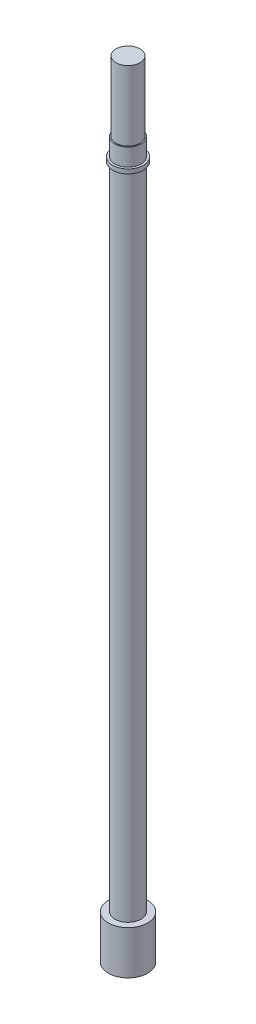
ISO-10303-21;
HEADER;
FILE_DESCRIPTION(('STEP AP214'),'2;1');
FILE_NAME('part.step','',(''),(''),'','','');
FILE_SCHEMA(('AUTOMOTIVE_DESIGN { 1 0 10303 214 1 1 1 1 }'));
ENDSEC;
DATA;
#1=APPLICATION_CONTEXT('core data for automotive mechanical design processes');
#2=APPLICATION_PROTOCOL_DEFINITION('international standard','automotive_design',2000,#1);
#3=PRODUCT_CONTEXT('',#1,'mechanical');
#4=PRODUCT('Part','Part','',(#3));
#5=PRODUCT_RELATED_PRODUCT_CATEGORY('part','',(#4));
#6=PRODUCT_DEFINITION_FORMATION('','',#4);
#7=PRODUCT_DEFINITION_CONTEXT('part definition',#1,'design');
#8=PRODUCT_DEFINITION('design','',#6,#7);
#9=PRODUCT_DEFINITION_SHAPE('','',#8);
#10=(LENGTH_UNIT() NAMED_UNIT(*) SI_UNIT(.MILLI.,.METRE.));
#11=(NAMED_UNIT(*) PLANE_ANGLE_UNIT() SI_UNIT($,.RADIAN.));
#12=(NAMED_UNIT(*) SI_UNIT($,.STERADIAN.) SOLID_ANGLE_UNIT());
#13=UNCERTAINTY_MEASURE_WITH_UNIT(LENGTH_MEASURE(1.E-05),#10,'distance_accuracy_value','');
#14=(GEOMETRIC_REPRESENTATION_CONTEXT(3) GLOBAL_UNCERTAINTY_ASSIGNED_CONTEXT((#13)) GLOBAL_UNIT_ASSIGNED_CONTEXT((#10,
#11,#12)) REPRESENTATION_CONTEXT('',''));
#15=CARTESIAN_POINT('',(0.,0.,0.));
#16=DIRECTION('',(0.,0.,1.));
#17=DIRECTION('',(1.,0.,0.));
#18=AXIS2_PLACEMENT_3D('',#15,#16,#17);
#19=CARTESIAN_POINT('',(0.,170.,0.));
#20=DIRECTION('',(0.,-1.,0.));
#21=DIRECTION('',(0.,0.,-1.));
#22=AXIS2_PLACEMENT_3D('',#19,#20,#21);
#23=CYLINDRICAL_SURFACE('',#22,3.);
#24=CARTESIAN_POINT('',(0.,150.,0.));
#25=DIRECTION('',(0.,1.,0.));
#26=DIRECTION('',(0.,0.,1.));
#27=AXIS2_PLACEMENT_3D('',#24,#25,#26);
#28=CIRCLE('',#27,3.);
#29=CARTESIAN_POINT('',(0.,150.,3.));
#30=VERTEX_POINT('',#29);
#31=EDGE_CURVE('E37',#30,#30,#28,.T.);
#32=ORIENTED_EDGE('',*,*,#31,.T.);
#33=EDGE_LOOP('',(#32));
#34=FACE_BOUND('',#33,.T.);
#35=CARTESIAN_POINT('',(0.,154.,0.));
#36=DIRECTION('',(0.,1.,0.));
#37=DIRECTION('',(0.,0.,1.));
#38=AXIS2_PLACEMENT_3D('',#35,#36,#37);
#39=CIRCLE('',#38,3.);
#40=CARTESIAN_POINT('',(0.,154.,3.));
#41=VERTEX_POINT('',#40);
#42=EDGE_CURVE('E48',#41,#41,#39,.T.);
#43=ORIENTED_EDGE('',*,*,#42,.F.);
#44=EDGE_LOOP('',(#43));
#45=FACE_BOUND('',#44,.T.);
#46=ADVANCED_FACE('F34',(#34,#45),#23,.T.);
#47=CARTESIAN_POINT('',(0.,154.,0.));
#48=DIRECTION('',(0.,1.,0.));
#49=DIRECTION('',(0.,0.,1.));
#50=AXIS2_PLACEMENT_3D('',#47,#48,#49);
#51=PLANE('',#50);
#52=CARTESIAN_POINT('',(0.,154.,0.));
#53=DIRECTION('',(0.,1.,0.));
#54=DIRECTION('',(0.,0.,1.));
#55=AXIS2_PLACEMENT_3D('',#52,#53,#54);
#56=CIRCLE('',#55,2.75);
#57=CARTESIAN_POINT('',(0.,154.,2.75));
#58=VERTEX_POINT('',#57);
#59=EDGE_CURVE('E51',#58,#58,#56,.T.);
#60=ORIENTED_EDGE('',*,*,#59,.F.);
#61=EDGE_LOOP('',(#60));
#62=FACE_BOUND('',#61,.T.);
#63=ORIENTED_EDGE('',*,*,#42,.T.);
#64=EDGE_LOOP('',(#63));
#65=FACE_BOUND('',#64,.T.);
#66=ADVANCED_FACE('F89',(#62,#65),#51,.T.);
#67=CARTESIAN_POINT('',(0.,154.,0.));
#68=DIRECTION('',(0.,1.,0.));
#69=DIRECTION('',(0.,0.,1.));
#70=AXIS2_PLACEMENT_3D('',#67,#68,#69);
#71=CYLINDRICAL_SURFACE('',#70,2.75);
#72=ORIENTED_EDGE('',*,*,#59,.T.);
#73=EDGE_LOOP('',(#72));
#74=FACE_BOUND('',#73,.T.);
#75=CARTESIAN_POINT('',(0.,170.,0.));
#76=DIRECTION('',(0.,1.,0.));
#77=DIRECTION('',(0.,0.,1.));
#78=AXIS2_PLACEMENT_3D('',#75,#76,#77);
#79=CIRCLE('',#78,2.75);
#80=CARTESIAN_POINT('',(0.,170.,2.75));
#81=VERTEX_POINT('',#80);
#82=EDGE_CURVE('E57',#81,#81,#79,.T.);
#83=ORIENTED_EDGE('',*,*,#82,.F.);
#84=EDGE_LOOP('',(#83));
#85=FACE_BOUND('',#84,.T.);
#86=ADVANCED_FACE('F96',(#74,#85),#71,.T.);
#87=CARTESIAN_POINT('',(0.,170.,0.));
#88=DIRECTION('',(0.,1.,0.));
#89=DIRECTION('',(0.,0.,1.));
#90=AXIS2_PLACEMENT_3D('',#87,#88,#89);
#91=PLANE('',#90);
#92=ORIENTED_EDGE('',*,*,#82,.T.);
#93=EDGE_LOOP('',(#92));
#94=FACE_BOUND('',#93,.T.);
#95=ADVANCED_FACE('F85',(#94),#91,.T.);
#96=CARTESIAN_POINT('',(0.,150.,0.));
#97=DIRECTION('',(0.,-1.,0.));
#98=DIRECTION('',(0.,0.,-1.));
#99=AXIS2_PLACEMENT_3D('',#96,#97,#98);
#100=CYLINDRICAL_SURFACE('',#99,3.5);
#101=CARTESIAN_POINT('',(0.,150.,0.));
#102=DIRECTION('',(0.,1.,0.));
#103=DIRECTION('',(0.,0.,1.));
#104=AXIS2_PLACEMENT_3D('',#101,#102,#103);
#105=CIRCLE('',#104,3.5);
#106=CARTESIAN_POINT('',(0.,150.,3.5));
#107=VERTEX_POINT('',#106);
#108=EDGE_CURVE('E65',#107,#107,#105,.T.);
#109=ORIENTED_EDGE('',*,*,#108,.F.);
#110=EDGE_LOOP('',(#109));
#111=FACE_BOUND('',#110,.T.);
#112=CARTESIAN_POINT('',(0.,149.,0.));
#113=DIRECTION('',(0.,1.,0.));
#114=DIRECTION('',(0.,0.,1.));
#115=AXIS2_PLACEMENT_3D('',#112,#113,#114);
#116=CIRCLE('',#115,3.5);
#117=CARTESIAN_POINT('',(0.,149.,3.5));
#118=VERTEX_POINT('',#117);
#119=EDGE_CURVE('E62',#118,#118,#116,.T.);
#120=ORIENTED_EDGE('',*,*,#119,.T.);
#121=EDGE_LOOP('',(#120));
#122=FACE_BOUND('',#121,.T.);
#123=ADVANCED_FACE('F77',(#111,#122),#100,.T.);
#124=CARTESIAN_POINT('',(0.,150.,0.));
#125=DIRECTION('',(0.,1.,0.));
#126=DIRECTION('',(0.,0.,1.));
#127=AXIS2_PLACEMENT_3D('',#124,#125,#126);
#128=PLANE('',#127);
#129=ORIENTED_EDGE('',*,*,#31,.F.);
#130=EDGE_LOOP('',(#129));
#131=FACE_BOUND('',#130,.T.);
#132=ORIENTED_EDGE('',*,*,#108,.T.);
#133=EDGE_LOOP('',(#132));
#134=FACE_BOUND('',#133,.T.);
#135=ADVANCED_FACE('F74',(#131,#134),#128,.T.);
#136=CARTESIAN_POINT('',(0.,149.,0.));
#137=DIRECTION('',(0.,1.,0.));
#138=DIRECTION('',(0.,0.,1.));
#139=AXIS2_PLACEMENT_3D('',#136,#137,#138);
#140=PLANE('',#139);
#141=CARTESIAN_POINT('',(0.,149.,0.));
#142=DIRECTION('',(0.,1.,0.));
#143=DIRECTION('',(0.,0.,1.));
#144=AXIS2_PLACEMENT_3D('',#141,#142,#143);
#145=CIRCLE('',#144,3.);
#146=CARTESIAN_POINT('',(0.,149.,3.));
#147=VERTEX_POINT('',#146);
#148=EDGE_CURVE('E11',#147,#147,#145,.T.);
#149=ORIENTED_EDGE('',*,*,#148,.T.);
#150=EDGE_LOOP('',(#149));
#151=FACE_BOUND('',#150,.T.);
#152=ORIENTED_EDGE('',*,*,#119,.F.);
#153=EDGE_LOOP('',(#152));
#154=FACE_BOUND('',#153,.T.);
#155=ADVANCED_FACE('F76',(#151,#154),#140,.F.);
#156=CARTESIAN_POINT('',(0.,-10.,0.));
#157=DIRECTION('',(0.,-1.,0.));
#158=DIRECTION('',(0.,0.,-1.));
#159=AXIS2_PLACEMENT_3D('',#156,#157,#158);
#160=PLANE('',#159);
#161=CARTESIAN_POINT('',(0.,-10.,0.));
#162=DIRECTION('',(0.,-1.,0.));
#163=DIRECTION('',(0.,0.,-1.));
#164=AXIS2_PLACEMENT_3D('',#161,#162,#163);
#165=CIRCLE('',#164,4.5);
#166=CARTESIAN_POINT('',(0.,-10.,-4.5));
#167=VERTEX_POINT('',#166);
#168=EDGE_CURVE('E45',#167,#167,#165,.T.);
#169=ORIENTED_EDGE('',*,*,#168,.T.);
#170=EDGE_LOOP('',(#169));
#171=FACE_BOUND('',#170,.T.);
#172=ADVANCED_FACE('F83',(#171),#160,.T.);
#173=CARTESIAN_POINT('',(0.,-10.,0.));
#174=DIRECTION('',(0.,1.,0.));
#175=DIRECTION('',(0.,0.,1.));
#176=AXIS2_PLACEMENT_3D('',#173,#174,#175);
#177=CYLINDRICAL_SURFACE('',#176,4.5);
#178=ORIENTED_EDGE('',*,*,#168,.F.);
#179=EDGE_LOOP('',(#178));
#180=FACE_BOUND('',#179,.T.);
#181=CARTESIAN_POINT('',(0.,0.,0.));
#182=DIRECTION('',(0.,-1.,0.));
#183=DIRECTION('',(0.,0.,-1.));
#184=AXIS2_PLACEMENT_3D('',#181,#182,#183);
#185=CIRCLE('',#184,4.5);
#186=CARTESIAN_POINT('',(0.,0.,-4.5));
#187=VERTEX_POINT('',#186);
#188=EDGE_CURVE('E50',#187,#187,#185,.T.);
#189=ORIENTED_EDGE('',*,*,#188,.T.);
#190=EDGE_LOOP('',(#189));
#191=FACE_BOUND('',#190,.T.);
#192=ADVANCED_FACE('F106',(#180,#191),#177,.T.);
#193=CARTESIAN_POINT('',(0.,0.,0.));
#194=DIRECTION('',(0.,-1.,0.));
#195=DIRECTION('',(0.,0.,-1.));
#196=AXIS2_PLACEMENT_3D('',#193,#194,#195);
#197=PLANE('',#196);
#198=CARTESIAN_POINT('',(0.,0.,0.));
#199=DIRECTION('',(0.,-1.,0.));
#200=DIRECTION('',(0.,0.,-1.));
#201=AXIS2_PLACEMENT_3D('',#198,#199,#200);
#202=CIRCLE('',#201,3.);
#203=CARTESIAN_POINT('',(0.,0.,-3.));
#204=VERTEX_POINT('',#203);
#205=EDGE_CURVE('E41',#204,#204,#202,.T.);
#206=ORIENTED_EDGE('',*,*,#205,.T.);
#207=EDGE_LOOP('',(#206));
#208=FACE_BOUND('',#207,.T.);
#209=ORIENTED_EDGE('',*,*,#188,.F.);
#210=EDGE_LOOP('',(#209));
#211=FACE_BOUND('',#210,.T.);
#212=ADVANCED_FACE('F100',(#208,#211),#197,.F.);
#213=ORIENTED_EDGE('',*,*,#205,.F.);
#214=EDGE_LOOP('',(#213));
#215=FACE_BOUND('',#214,.T.);
#216=ORIENTED_EDGE('',*,*,#148,.F.);
#217=EDGE_LOOP('',(#216));
#218=FACE_BOUND('',#217,.T.);
#219=ADVANCED_FACE('F90',(#215,#218),#23,.T.);
#220=CLOSED_SHELL('',(#46,#66,#86,#95,#123,#135,#155,#172,#192,#212,#219));
#221=MANIFOLD_SOLID_BREP('B2',#220);
#222=ADVANCED_BREP_SHAPE_REPRESENTATION('',(#18,#221),#14);
#223=SHAPE_DEFINITION_REPRESENTATION(#9,#222);
ENDSEC;
END-ISO-10303-21;
